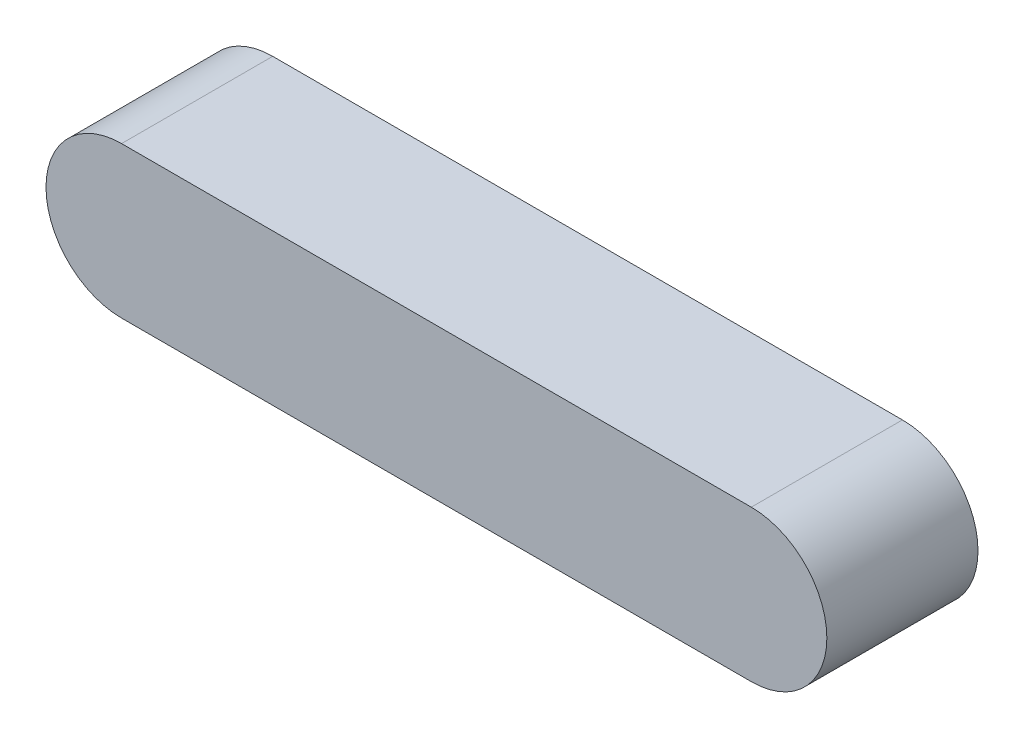
ISO-10303-21;
HEADER;
FILE_DESCRIPTION(('STEP AP214'),'2;1');
FILE_NAME('part.step','',(''),(''),'','','');
FILE_SCHEMA(('AUTOMOTIVE_DESIGN { 1 0 10303 214 1 1 1 1 }'));
ENDSEC;
DATA;
#1=APPLICATION_CONTEXT('core data for automotive mechanical design processes');
#2=APPLICATION_PROTOCOL_DEFINITION('international standard','automotive_design',2000,#1);
#3=PRODUCT_CONTEXT('',#1,'mechanical');
#4=PRODUCT('Part','Part','',(#3));
#5=PRODUCT_RELATED_PRODUCT_CATEGORY('part','',(#4));
#6=PRODUCT_DEFINITION_FORMATION('','',#4);
#7=PRODUCT_DEFINITION_CONTEXT('part definition',#1,'design');
#8=PRODUCT_DEFINITION('design','',#6,#7);
#9=PRODUCT_DEFINITION_SHAPE('','',#8);
#10=(LENGTH_UNIT() NAMED_UNIT(*) SI_UNIT(.MILLI.,.METRE.));
#11=(NAMED_UNIT(*) PLANE_ANGLE_UNIT() SI_UNIT($,.RADIAN.));
#12=(NAMED_UNIT(*) SI_UNIT($,.STERADIAN.) SOLID_ANGLE_UNIT());
#13=UNCERTAINTY_MEASURE_WITH_UNIT(LENGTH_MEASURE(1.E-05),#10,'distance_accuracy_value','');
#14=(GEOMETRIC_REPRESENTATION_CONTEXT(3) GLOBAL_UNCERTAINTY_ASSIGNED_CONTEXT((#13)) GLOBAL_UNIT_ASSIGNED_CONTEXT((#10,
#11,#12)) REPRESENTATION_CONTEXT('',''));
#15=CARTESIAN_POINT('',(0.,0.,0.));
#16=DIRECTION('',(0.,0.,1.));
#17=DIRECTION('',(1.,0.,0.));
#18=AXIS2_PLACEMENT_3D('',#15,#16,#17);
#19=CARTESIAN_POINT('',(-12.5,0.,-6.));
#20=DIRECTION('',(0.,0.,1.));
#21=DIRECTION('',(1.,0.,0.));
#22=AXIS2_PLACEMENT_3D('',#19,#20,#21);
#23=CYLINDRICAL_SURFACE('',#22,3.);
#24=CARTESIAN_POINT('',(-12.5,0.,0.));
#25=DIRECTION('',(0.,0.,1.));
#26=DIRECTION('',(1.,0.,0.));
#27=AXIS2_PLACEMENT_3D('',#24,#25,#26);
#28=CIRCLE('',#27,3.);
#29=CARTESIAN_POINT('',(-12.5,3.,0.));
#30=VERTEX_POINT('',#29);
#31=CARTESIAN_POINT('',(-12.5,-3.,0.));
#32=VERTEX_POINT('',#31);
#33=EDGE_CURVE('E100',#30,#32,#28,.T.);
#34=ORIENTED_EDGE('',*,*,#33,.F.);
#35=DIRECTION('',(0.,0.,1.));
#36=VECTOR('',#35,1.);
#37=CARTESIAN_POINT('',(-12.5,3.,-6.));
#38=LINE('',#37,#36);
#39=CARTESIAN_POINT('',(-12.5,3.,-6.));
#40=VERTEX_POINT('',#39);
#41=EDGE_CURVE('E11',#40,#30,#38,.T.);
#42=ORIENTED_EDGE('',*,*,#41,.F.);
#43=CARTESIAN_POINT('',(-12.5,0.,-6.));
#44=DIRECTION('',(0.,0.,1.));
#45=DIRECTION('',(1.,0.,0.));
#46=AXIS2_PLACEMENT_3D('',#43,#44,#45);
#47=CIRCLE('',#46,3.);
#48=CARTESIAN_POINT('',(-12.5,-3.,-6.));
#49=VERTEX_POINT('',#48);
#50=EDGE_CURVE('E94',#40,#49,#47,.T.);
#51=ORIENTED_EDGE('',*,*,#50,.T.);
#52=DIRECTION('',(0.,0.,1.));
#53=VECTOR('',#52,1.);
#54=CARTESIAN_POINT('',(-12.5,-3.,-6.));
#55=LINE('',#54,#53);
#56=EDGE_CURVE('E39',#49,#32,#55,.T.);
#57=ORIENTED_EDGE('',*,*,#56,.T.);
#58=EDGE_LOOP('',(#34,#42,#51,#57));
#59=FACE_BOUND('',#58,.T.);
#60=ADVANCED_FACE('F36',(#59),#23,.T.);
#61=CARTESIAN_POINT('',(-12.5,3.,-6.));
#62=DIRECTION('',(0.,1.,0.));
#63=DIRECTION('',(-1.,0.,0.));
#64=AXIS2_PLACEMENT_3D('',#61,#62,#63);
#65=PLANE('',#64);
#66=DIRECTION('',(-1.,0.,0.));
#67=VECTOR('',#66,1.);
#68=CARTESIAN_POINT('',(-12.5,3.,0.));
#69=LINE('',#68,#67);
#70=CARTESIAN_POINT('',(12.5,3.,0.));
#71=VERTEX_POINT('',#70);
#72=EDGE_CURVE('E96',#71,#30,#69,.T.);
#73=ORIENTED_EDGE('',*,*,#72,.F.);
#74=DIRECTION('',(0.,0.,1.));
#75=VECTOR('',#74,1.);
#76=CARTESIAN_POINT('',(12.5,3.,-6.));
#77=LINE('',#76,#75);
#78=CARTESIAN_POINT('',(12.5,3.,-6.));
#79=VERTEX_POINT('',#78);
#80=EDGE_CURVE('E45',#79,#71,#77,.T.);
#81=ORIENTED_EDGE('',*,*,#80,.F.);
#82=DIRECTION('',(-1.,0.,0.));
#83=VECTOR('',#82,1.);
#84=CARTESIAN_POINT('',(-12.5,3.,-6.));
#85=LINE('',#84,#83);
#86=EDGE_CURVE('E91',#79,#40,#85,.T.);
#87=ORIENTED_EDGE('',*,*,#86,.T.);
#88=ORIENTED_EDGE('',*,*,#41,.T.);
#89=EDGE_LOOP('',(#73,#81,#87,#88));
#90=FACE_BOUND('',#89,.T.);
#91=ADVANCED_FACE('F110',(#90),#65,.T.);
#92=CARTESIAN_POINT('',(12.5,0.,-6.));
#93=DIRECTION('',(0.,0.,1.));
#94=DIRECTION('',(1.,0.,0.));
#95=AXIS2_PLACEMENT_3D('',#92,#93,#94);
#96=CYLINDRICAL_SURFACE('',#95,3.);
#97=CARTESIAN_POINT('',(12.5,0.,0.));
#98=DIRECTION('',(0.,0.,1.));
#99=DIRECTION('',(1.,0.,0.));
#100=AXIS2_PLACEMENT_3D('',#97,#98,#99);
#101=CIRCLE('',#100,3.);
#102=CARTESIAN_POINT('',(12.5,-3.,0.));
#103=VERTEX_POINT('',#102);
#104=EDGE_CURVE('E86',#103,#71,#101,.T.);
#105=ORIENTED_EDGE('',*,*,#104,.F.);
#106=DIRECTION('',(0.,0.,1.));
#107=VECTOR('',#106,1.);
#108=CARTESIAN_POINT('',(12.5,-3.,-6.));
#109=LINE('',#108,#107);
#110=CARTESIAN_POINT('',(12.5,-3.,-6.));
#111=VERTEX_POINT('',#110);
#112=EDGE_CURVE('E81',#111,#103,#109,.T.);
#113=ORIENTED_EDGE('',*,*,#112,.F.);
#114=CARTESIAN_POINT('',(12.5,0.,-6.));
#115=DIRECTION('',(0.,0.,1.));
#116=DIRECTION('',(1.,0.,0.));
#117=AXIS2_PLACEMENT_3D('',#114,#115,#116);
#118=CIRCLE('',#117,3.);
#119=EDGE_CURVE('E84',#111,#79,#118,.T.);
#120=ORIENTED_EDGE('',*,*,#119,.T.);
#121=ORIENTED_EDGE('',*,*,#80,.T.);
#122=EDGE_LOOP('',(#105,#113,#120,#121));
#123=FACE_BOUND('',#122,.T.);
#124=ADVANCED_FACE('F83',(#123),#96,.T.);
#125=CARTESIAN_POINT('',(12.5,-3.,-6.));
#126=DIRECTION('',(0.,-1.,0.));
#127=DIRECTION('',(0.,0.,-1.));
#128=AXIS2_PLACEMENT_3D('',#125,#126,#127);
#129=PLANE('',#128);
#130=DIRECTION('',(1.,0.,0.));
#131=VECTOR('',#130,1.);
#132=CARTESIAN_POINT('',(12.5,-3.,0.));
#133=LINE('',#132,#131);
#134=EDGE_CURVE('E103',#32,#103,#133,.T.);
#135=ORIENTED_EDGE('',*,*,#134,.F.);
#136=ORIENTED_EDGE('',*,*,#56,.F.);
#137=DIRECTION('',(1.,0.,0.));
#138=VECTOR('',#137,1.);
#139=CARTESIAN_POINT('',(12.5,-3.,-6.));
#140=LINE('',#139,#138);
#141=EDGE_CURVE('E90',#49,#111,#140,.T.);
#142=ORIENTED_EDGE('',*,*,#141,.T.);
#143=ORIENTED_EDGE('',*,*,#112,.T.);
#144=EDGE_LOOP('',(#135,#136,#142,#143));
#145=FACE_BOUND('',#144,.T.);
#146=ADVANCED_FACE('F93',(#145),#129,.T.);
#147=CARTESIAN_POINT('',(-12.5,0.,-6.));
#148=DIRECTION('',(0.,0.,1.));
#149=DIRECTION('',(1.,0.,0.));
#150=AXIS2_PLACEMENT_3D('',#147,#148,#149);
#151=PLANE('',#150);
#152=ORIENTED_EDGE('',*,*,#50,.F.);
#153=ORIENTED_EDGE('',*,*,#86,.F.);
#154=ORIENTED_EDGE('',*,*,#119,.F.);
#155=ORIENTED_EDGE('',*,*,#141,.F.);
#156=EDGE_LOOP('',(#152,#153,#154,#155));
#157=FACE_BOUND('',#156,.T.);
#158=ADVANCED_FACE('F89',(#157),#151,.F.);
#159=CARTESIAN_POINT('',(-12.5,0.,0.));
#160=DIRECTION('',(0.,0.,1.));
#161=DIRECTION('',(1.,0.,0.));
#162=AXIS2_PLACEMENT_3D('',#159,#160,#161);
#163=PLANE('',#162);
#164=ORIENTED_EDGE('',*,*,#33,.T.);
#165=ORIENTED_EDGE('',*,*,#134,.T.);
#166=ORIENTED_EDGE('',*,*,#104,.T.);
#167=ORIENTED_EDGE('',*,*,#72,.T.);
#168=EDGE_LOOP('',(#164,#165,#166,#167));
#169=FACE_BOUND('',#168,.T.);
#170=ADVANCED_FACE('F109',(#169),#163,.T.);
#171=CLOSED_SHELL('',(#60,#91,#124,#146,#158,#170));
#172=MANIFOLD_SOLID_BREP('B2',#171);
#173=ADVANCED_BREP_SHAPE_REPRESENTATION('',(#18,#172),#14);
#174=SHAPE_DEFINITION_REPRESENTATION(#9,#173);
ENDSEC;
END-ISO-10303-21;
